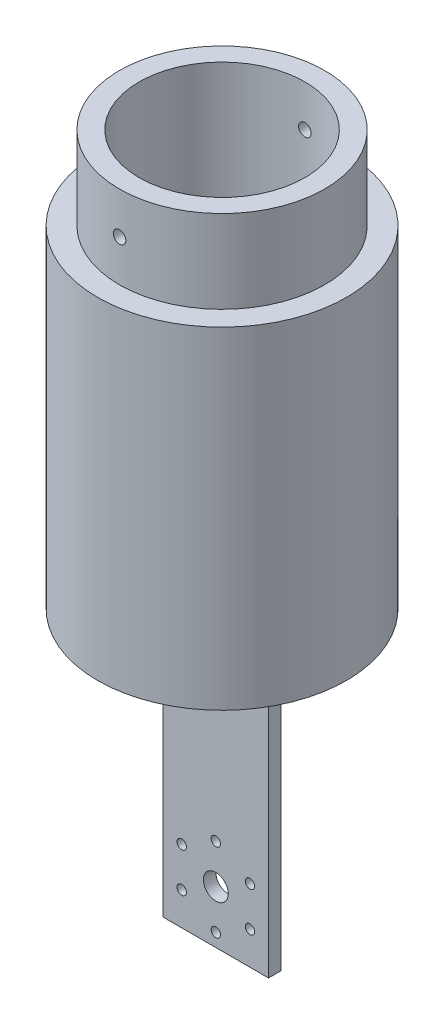
ISO-10303-21;
HEADER;
FILE_DESCRIPTION(('STEP AP214'),'2;1');
FILE_NAME('part.step','',(''),(''),'','','');
FILE_SCHEMA(('AUTOMOTIVE_DESIGN { 1 0 10303 214 1 1 1 1 }'));
ENDSEC;
DATA;
#1=APPLICATION_CONTEXT('core data for automotive mechanical design processes');
#2=APPLICATION_PROTOCOL_DEFINITION('international standard','automotive_design',2000,#1);
#3=PRODUCT_CONTEXT('',#1,'mechanical');
#4=PRODUCT('Part','Part','',(#3));
#5=PRODUCT_RELATED_PRODUCT_CATEGORY('part','',(#4));
#6=PRODUCT_DEFINITION_FORMATION('','',#4);
#7=PRODUCT_DEFINITION_CONTEXT('part definition',#1,'design');
#8=PRODUCT_DEFINITION('design','',#6,#7);
#9=PRODUCT_DEFINITION_SHAPE('','',#8);
#10=(LENGTH_UNIT() NAMED_UNIT(*) SI_UNIT(.MILLI.,.METRE.));
#11=(NAMED_UNIT(*) PLANE_ANGLE_UNIT() SI_UNIT($,.RADIAN.));
#12=(NAMED_UNIT(*) SI_UNIT($,.STERADIAN.) SOLID_ANGLE_UNIT());
#13=UNCERTAINTY_MEASURE_WITH_UNIT(LENGTH_MEASURE(1.E-05),#10,'distance_accuracy_value','');
#14=(GEOMETRIC_REPRESENTATION_CONTEXT(3) GLOBAL_UNCERTAINTY_ASSIGNED_CONTEXT((#13)) GLOBAL_UNIT_ASSIGNED_CONTEXT((#10,
#11,#12)) REPRESENTATION_CONTEXT('',''));
#15=CARTESIAN_POINT('',(0.,0.,0.));
#16=DIRECTION('',(0.,0.,1.));
#17=DIRECTION('',(1.,0.,0.));
#18=AXIS2_PLACEMENT_3D('',#15,#16,#17);
#19=CARTESIAN_POINT('',(12.7,150.,-1.5));
#20=DIRECTION('',(0.,1.,0.));
#21=DIRECTION('',(0.,0.,1.));
#22=AXIS2_PLACEMENT_3D('',#19,#20,#21);
#23=PLANE('',#22);
#24=CARTESIAN_POINT('',(12.7,150.,-1.5));
#25=DIRECTION('',(0.,1.,0.));
#26=DIRECTION('',(0.,0.,1.));
#27=AXIS2_PLACEMENT_3D('',#24,#25,#26);
#28=CIRCLE('',#27,30.);
#29=CARTESIAN_POINT('',(12.7,150.,28.5));
#30=VERTEX_POINT('',#29);
#31=EDGE_CURVE('E230',#30,#30,#28,.T.);
#32=ORIENTED_EDGE('',*,*,#31,.T.);
#33=EDGE_LOOP('',(#32));
#34=FACE_BOUND('',#33,.T.);
#35=CARTESIAN_POINT('',(12.7,150.,-1.5));
#36=DIRECTION('',(0.,1.,0.));
#37=DIRECTION('',(0.,0.,1.));
#38=AXIS2_PLACEMENT_3D('',#35,#36,#37);
#39=CIRCLE('',#38,24.75);
#40=CARTESIAN_POINT('',(12.7,150.,23.25));
#41=VERTEX_POINT('',#40);
#42=EDGE_CURVE('E233',#41,#41,#39,.T.);
#43=ORIENTED_EDGE('',*,*,#42,.F.);
#44=EDGE_LOOP('',(#43));
#45=FACE_BOUND('',#44,.T.);
#46=ADVANCED_FACE('F35',(#34,#45),#23,.T.);
#47=CARTESIAN_POINT('',(0.,70.,-3.));
#48=DIRECTION('',(1.,0.,0.));
#49=DIRECTION('',(0.,0.,-1.));
#50=AXIS2_PLACEMENT_3D('',#47,#48,#49);
#51=PLANE('',#50);
#52=DIRECTION('',(0.,0.,1.));
#53=VECTOR('',#52,1.);
#54=CARTESIAN_POINT('',(0.,0.,-3.));
#55=LINE('',#54,#53);
#56=CARTESIAN_POINT('',(0.,0.,-3.));
#57=VERTEX_POINT('',#56);
#58=CARTESIAN_POINT('',(0.,0.,0.));
#59=VERTEX_POINT('',#58);
#60=EDGE_CURVE('E103',#57,#59,#55,.T.);
#61=ORIENTED_EDGE('',*,*,#60,.T.);
#62=DIRECTION('',(0.,-1.,0.));
#63=VECTOR('',#62,1.);
#64=CARTESIAN_POINT('',(0.,70.,0.));
#65=LINE('',#64,#63);
#66=CARTESIAN_POINT('',(0.,70.,0.));
#67=VERTEX_POINT('',#66);
#68=EDGE_CURVE('E11',#67,#59,#65,.T.);
#69=ORIENTED_EDGE('',*,*,#68,.F.);
#70=DIRECTION('',(0.,0.,1.));
#71=VECTOR('',#70,1.);
#72=CARTESIAN_POINT('',(0.,70.,-3.));
#73=LINE('',#72,#71);
#74=CARTESIAN_POINT('',(0.,70.,-3.));
#75=VERTEX_POINT('',#74);
#76=EDGE_CURVE('E86',#75,#67,#73,.T.);
#77=ORIENTED_EDGE('',*,*,#76,.F.);
#78=DIRECTION('',(0.,-1.,0.));
#79=VECTOR('',#78,1.);
#80=CARTESIAN_POINT('',(0.,70.,-3.));
#81=LINE('',#80,#79);
#82=EDGE_CURVE('E88',#75,#57,#81,.T.);
#83=ORIENTED_EDGE('',*,*,#82,.T.);
#84=EDGE_LOOP('',(#61,#69,#77,#83));
#85=FACE_BOUND('',#84,.T.);
#86=ADVANCED_FACE('F37',(#85),#51,.F.);
#87=CARTESIAN_POINT('',(0.,70.,0.));
#88=DIRECTION('',(0.,0.,-1.));
#89=DIRECTION('',(-1.,0.,0.));
#90=AXIS2_PLACEMENT_3D('',#87,#88,#89);
#91=PLANE('',#90);
#92=CARTESIAN_POINT('',(12.7,12.7,0.));
#93=DIRECTION('',(0.,0.,1.));
#94=DIRECTION('',(1.,0.,0.));
#95=AXIS2_PLACEMENT_3D('',#92,#93,#94);
#96=CIRCLE('',#95,3.);
#97=CARTESIAN_POINT('',(15.7,12.7,0.));
#98=VERTEX_POINT('',#97);
#99=EDGE_CURVE('E203',#98,#98,#96,.T.);
#100=ORIENTED_EDGE('',*,*,#99,.F.);
#101=EDGE_LOOP('',(#100));
#102=FACE_BOUND('',#101,.T.);
#103=CARTESIAN_POINT('',(12.7,22.2,0.));
#104=DIRECTION('',(0.,0.,1.));
#105=DIRECTION('',(1.,0.,0.));
#106=AXIS2_PLACEMENT_3D('',#103,#104,#105);
#107=CIRCLE('',#106,1.13029999999999);
#108=CARTESIAN_POINT('',(13.8303,22.2,0.));
#109=VERTEX_POINT('',#108);
#110=EDGE_CURVE('E207',#109,#109,#107,.T.);
#111=ORIENTED_EDGE('',*,*,#110,.F.);
#112=EDGE_LOOP('',(#111));
#113=FACE_BOUND('',#112,.T.);
#114=CARTESIAN_POINT('',(20.9272413359524,17.4500000000003,0.));
#115=DIRECTION('',(0.,0.,1.));
#116=DIRECTION('',(1.,0.,0.));
#117=AXIS2_PLACEMENT_3D('',#114,#115,#116);
#118=CIRCLE('',#117,1.13029999999999);
#119=CARTESIAN_POINT('',(22.0575413359524,17.4500000000003,0.));
#120=VERTEX_POINT('',#119);
#121=EDGE_CURVE('E211',#120,#120,#118,.T.);
#122=ORIENTED_EDGE('',*,*,#121,.F.);
#123=EDGE_LOOP('',(#122));
#124=FACE_BOUND('',#123,.T.);
#125=CARTESIAN_POINT('',(20.9272413359527,7.95000000000028,0.));
#126=DIRECTION('',(0.,0.,1.));
#127=DIRECTION('',(1.,0.,0.));
#128=AXIS2_PLACEMENT_3D('',#125,#126,#127);
#129=CIRCLE('',#128,1.13029999999999);
#130=CARTESIAN_POINT('',(22.0575413359527,7.95000000000028,0.));
#131=VERTEX_POINT('',#130);
#132=EDGE_CURVE('E215',#131,#131,#129,.T.);
#133=ORIENTED_EDGE('',*,*,#132,.F.);
#134=EDGE_LOOP('',(#133));
#135=FACE_BOUND('',#134,.T.);
#136=CARTESIAN_POINT('',(12.7000000000007,3.2,0.));
#137=DIRECTION('',(0.,0.,1.));
#138=DIRECTION('',(1.,0.,0.));
#139=AXIS2_PLACEMENT_3D('',#136,#137,#138);
#140=CIRCLE('',#139,1.13029999999999);
#141=CARTESIAN_POINT('',(13.8303000000007,3.2,0.));
#142=VERTEX_POINT('',#141);
#143=EDGE_CURVE('E219',#142,#142,#140,.T.);
#144=ORIENTED_EDGE('',*,*,#143,.F.);
#145=EDGE_LOOP('',(#144));
#146=FACE_BOUND('',#145,.T.);
#147=CARTESIAN_POINT('',(4.47275866404834,7.94999999999975,0.));
#148=DIRECTION('',(0.,0.,1.));
#149=DIRECTION('',(1.,0.,0.));
#150=AXIS2_PLACEMENT_3D('',#147,#148,#149);
#151=CIRCLE('',#150,1.13029999999999);
#152=CARTESIAN_POINT('',(5.60305866404833,7.94999999999975,0.));
#153=VERTEX_POINT('',#152);
#154=EDGE_CURVE('E223',#153,#153,#151,.T.);
#155=ORIENTED_EDGE('',*,*,#154,.F.);
#156=EDGE_LOOP('',(#155));
#157=FACE_BOUND('',#156,.T.);
#158=CARTESIAN_POINT('',(4.47275866404807,17.4499999999998,0.));
#159=DIRECTION('',(0.,0.,1.));
#160=DIRECTION('',(1.,0.,0.));
#161=AXIS2_PLACEMENT_3D('',#158,#159,#160);
#162=CIRCLE('',#161,1.13029999999999);
#163=CARTESIAN_POINT('',(5.60305866404806,17.4499999999998,0.));
#164=VERTEX_POINT('',#163);
#165=EDGE_CURVE('E226',#164,#164,#162,.T.);
#166=ORIENTED_EDGE('',*,*,#165,.F.);
#167=EDGE_LOOP('',(#166));
#168=FACE_BOUND('',#167,.T.);
#169=DIRECTION('',(1.,0.,0.));
#170=VECTOR('',#169,1.);
#171=CARTESIAN_POINT('',(0.,0.,0.));
#172=LINE('',#171,#170);
#173=CARTESIAN_POINT('',(25.4,0.,0.));
#174=VERTEX_POINT('',#173);
#175=EDGE_CURVE('E105',#59,#174,#172,.T.);
#176=ORIENTED_EDGE('',*,*,#175,.T.);
#177=DIRECTION('',(0.,-1.,0.));
#178=VECTOR('',#177,1.);
#179=CARTESIAN_POINT('',(25.4,70.,0.));
#180=LINE('',#179,#178);
#181=CARTESIAN_POINT('',(25.4,70.,0.));
#182=VERTEX_POINT('',#181);
#183=EDGE_CURVE('E45',#182,#174,#180,.T.);
#184=ORIENTED_EDGE('',*,*,#183,.F.);
#185=DIRECTION('',(1.,0.,0.));
#186=VECTOR('',#185,1.);
#187=CARTESIAN_POINT('',(0.,70.,0.));
#188=LINE('',#187,#186);
#189=EDGE_CURVE('E80',#67,#182,#188,.T.);
#190=ORIENTED_EDGE('',*,*,#189,.F.);
#191=ORIENTED_EDGE('',*,*,#68,.T.);
#192=EDGE_LOOP('',(#176,#184,#190,#191));
#193=FACE_BOUND('',#192,.T.);
#194=ADVANCED_FACE('F172',(#102,#113,#124,#135,#146,#157,#168,#193),#91,.F.);
#195=CARTESIAN_POINT('',(25.4,70.,0.));
#196=DIRECTION('',(-1.,0.,0.));
#197=DIRECTION('',(0.,0.,1.));
#198=AXIS2_PLACEMENT_3D('',#195,#196,#197);
#199=PLANE('',#198);
#200=DIRECTION('',(0.,0.,-1.));
#201=VECTOR('',#200,1.);
#202=CARTESIAN_POINT('',(25.4,0.,0.));
#203=LINE('',#202,#201);
#204=CARTESIAN_POINT('',(25.4,0.,-3.));
#205=VERTEX_POINT('',#204);
#206=EDGE_CURVE('E70',#174,#205,#203,.T.);
#207=ORIENTED_EDGE('',*,*,#206,.T.);
#208=DIRECTION('',(0.,-1.,0.));
#209=VECTOR('',#208,1.);
#210=CARTESIAN_POINT('',(25.4,70.,-3.));
#211=LINE('',#210,#209);
#212=CARTESIAN_POINT('',(25.4,70.,-3.));
#213=VERTEX_POINT('',#212);
#214=EDGE_CURVE('E54',#213,#205,#211,.T.);
#215=ORIENTED_EDGE('',*,*,#214,.F.);
#216=DIRECTION('',(0.,0.,-1.));
#217=VECTOR('',#216,1.);
#218=CARTESIAN_POINT('',(25.4,70.,0.));
#219=LINE('',#218,#217);
#220=EDGE_CURVE('E98',#182,#213,#219,.T.);
#221=ORIENTED_EDGE('',*,*,#220,.F.);
#222=ORIENTED_EDGE('',*,*,#183,.T.);
#223=EDGE_LOOP('',(#207,#215,#221,#222));
#224=FACE_BOUND('',#223,.T.);
#225=ADVANCED_FACE('F193',(#224),#199,.F.);
#226=CARTESIAN_POINT('',(25.4,70.,-3.));
#227=DIRECTION('',(0.,0.,1.));
#228=DIRECTION('',(1.,0.,0.));
#229=AXIS2_PLACEMENT_3D('',#226,#227,#228);
#230=PLANE('',#229);
#231=CARTESIAN_POINT('',(12.7,12.7,-3.));
#232=DIRECTION('',(0.,0.,1.));
#233=DIRECTION('',(1.,0.,0.));
#234=AXIS2_PLACEMENT_3D('',#231,#232,#233);
#235=CIRCLE('',#234,3.);
#236=CARTESIAN_POINT('',(15.7,12.7,-3.));
#237=VERTEX_POINT('',#236);
#238=EDGE_CURVE('E39',#237,#237,#235,.T.);
#239=ORIENTED_EDGE('',*,*,#238,.T.);
#240=EDGE_LOOP('',(#239));
#241=FACE_BOUND('',#240,.T.);
#242=CARTESIAN_POINT('',(12.7,22.2,-3.));
#243=DIRECTION('',(0.,0.,1.));
#244=DIRECTION('',(1.,0.,0.));
#245=AXIS2_PLACEMENT_3D('',#242,#243,#244);
#246=CIRCLE('',#245,1.13029999999999);
#247=CARTESIAN_POINT('',(13.8303,22.2,-3.));
#248=VERTEX_POINT('',#247);
#249=EDGE_CURVE('E268',#248,#248,#246,.T.);
#250=ORIENTED_EDGE('',*,*,#249,.T.);
#251=EDGE_LOOP('',(#250));
#252=FACE_BOUND('',#251,.T.);
#253=CARTESIAN_POINT('',(20.9272413359524,17.4500000000003,-3.));
#254=DIRECTION('',(0.,0.,1.));
#255=DIRECTION('',(1.,0.,0.));
#256=AXIS2_PLACEMENT_3D('',#253,#254,#255);
#257=CIRCLE('',#256,1.13029999999999);
#258=CARTESIAN_POINT('',(22.0575413359524,17.4500000000003,-3.));
#259=VERTEX_POINT('',#258);
#260=EDGE_CURVE('E264',#259,#259,#257,.T.);
#261=ORIENTED_EDGE('',*,*,#260,.T.);
#262=EDGE_LOOP('',(#261));
#263=FACE_BOUND('',#262,.T.);
#264=CARTESIAN_POINT('',(20.9272413359527,7.95000000000028,-3.));
#265=DIRECTION('',(0.,0.,1.));
#266=DIRECTION('',(1.,0.,0.));
#267=AXIS2_PLACEMENT_3D('',#264,#265,#266);
#268=CIRCLE('',#267,1.13029999999999);
#269=CARTESIAN_POINT('',(22.0575413359527,7.95000000000028,-3.));
#270=VERTEX_POINT('',#269);
#271=EDGE_CURVE('E262',#270,#270,#268,.T.);
#272=ORIENTED_EDGE('',*,*,#271,.T.);
#273=EDGE_LOOP('',(#272));
#274=FACE_BOUND('',#273,.T.);
#275=CARTESIAN_POINT('',(12.7000000000007,3.2,-3.));
#276=DIRECTION('',(0.,0.,1.));
#277=DIRECTION('',(1.,0.,0.));
#278=AXIS2_PLACEMENT_3D('',#275,#276,#277);
#279=CIRCLE('',#278,1.13029999999999);
#280=CARTESIAN_POINT('',(13.8303000000007,3.2,-3.));
#281=VERTEX_POINT('',#280);
#282=EDGE_CURVE('E258',#281,#281,#279,.T.);
#283=ORIENTED_EDGE('',*,*,#282,.T.);
#284=EDGE_LOOP('',(#283));
#285=FACE_BOUND('',#284,.T.);
#286=CARTESIAN_POINT('',(4.47275866404834,7.94999999999975,-3.));
#287=DIRECTION('',(0.,0.,1.));
#288=DIRECTION('',(1.,0.,0.));
#289=AXIS2_PLACEMENT_3D('',#286,#287,#288);
#290=CIRCLE('',#289,1.13029999999999);
#291=CARTESIAN_POINT('',(5.60305866404833,7.94999999999975,-3.));
#292=VERTEX_POINT('',#291);
#293=EDGE_CURVE('E252',#292,#292,#290,.T.);
#294=ORIENTED_EDGE('',*,*,#293,.T.);
#295=EDGE_LOOP('',(#294));
#296=FACE_BOUND('',#295,.T.);
#297=CARTESIAN_POINT('',(4.47275866404807,17.4499999999998,-3.));
#298=DIRECTION('',(0.,0.,1.));
#299=DIRECTION('',(1.,0.,0.));
#300=AXIS2_PLACEMENT_3D('',#297,#298,#299);
#301=CIRCLE('',#300,1.13029999999999);
#302=CARTESIAN_POINT('',(5.60305866404806,17.4499999999998,-3.));
#303=VERTEX_POINT('',#302);
#304=EDGE_CURVE('E120',#303,#303,#301,.T.);
#305=ORIENTED_EDGE('',*,*,#304,.T.);
#306=EDGE_LOOP('',(#305));
#307=FACE_BOUND('',#306,.T.);
#308=DIRECTION('',(-1.,0.,0.));
#309=VECTOR('',#308,1.);
#310=CARTESIAN_POINT('',(25.4,0.,-3.));
#311=LINE('',#310,#309);
#312=EDGE_CURVE('E75',#205,#57,#311,.T.);
#313=ORIENTED_EDGE('',*,*,#312,.T.);
#314=ORIENTED_EDGE('',*,*,#82,.F.);
#315=DIRECTION('',(-1.,0.,0.));
#316=VECTOR('',#315,1.);
#317=CARTESIAN_POINT('',(25.4,70.,-3.));
#318=LINE('',#317,#316);
#319=EDGE_CURVE('E94',#213,#75,#318,.T.);
#320=ORIENTED_EDGE('',*,*,#319,.F.);
#321=ORIENTED_EDGE('',*,*,#214,.T.);
#322=EDGE_LOOP('',(#313,#314,#320,#321));
#323=FACE_BOUND('',#322,.T.);
#324=ADVANCED_FACE('F93',(#241,#252,#263,#274,#285,#296,#307,#323),#230,.F.);
#325=CARTESIAN_POINT('',(0.,0.,0.));
#326=DIRECTION('',(0.,1.,0.));
#327=DIRECTION('',(0.,0.,1.));
#328=AXIS2_PLACEMENT_3D('',#325,#326,#327);
#329=PLANE('',#328);
#330=ORIENTED_EDGE('',*,*,#60,.F.);
#331=ORIENTED_EDGE('',*,*,#312,.F.);
#332=ORIENTED_EDGE('',*,*,#206,.F.);
#333=ORIENTED_EDGE('',*,*,#175,.F.);
#334=EDGE_LOOP('',(#330,#331,#332,#333));
#335=FACE_BOUND('',#334,.T.);
#336=ADVANCED_FACE('F183',(#335),#329,.F.);
#337=CARTESIAN_POINT('',(12.7,70.,-1.5));
#338=DIRECTION('',(0.,1.,0.));
#339=DIRECTION('',(0.,0.,1.));
#340=AXIS2_PLACEMENT_3D('',#337,#338,#339);
#341=PLANE('',#340);
#342=CARTESIAN_POINT('',(12.7,70.,-1.5));
#343=DIRECTION('',(0.,1.,0.));
#344=DIRECTION('',(0.,0.,1.));
#345=AXIS2_PLACEMENT_3D('',#342,#343,#344);
#346=CIRCLE('',#345,30.);
#347=CARTESIAN_POINT('',(12.7,70.,28.5));
#348=VERTEX_POINT('',#347);
#349=EDGE_CURVE('E106',#348,#348,#346,.T.);
#350=ORIENTED_EDGE('',*,*,#349,.F.);
#351=EDGE_LOOP('',(#350));
#352=FACE_BOUND('',#351,.T.);
#353=ORIENTED_EDGE('',*,*,#319,.T.);
#354=ORIENTED_EDGE('',*,*,#76,.T.);
#355=ORIENTED_EDGE('',*,*,#189,.T.);
#356=ORIENTED_EDGE('',*,*,#220,.T.);
#357=EDGE_LOOP('',(#353,#354,#355,#356));
#358=FACE_BOUND('',#357,.T.);
#359=ADVANCED_FACE('F97',(#352,#358),#341,.F.);
#360=CARTESIAN_POINT('',(12.7,80.,-1.5));
#361=DIRECTION('',(0.,-1.,0.));
#362=DIRECTION('',(0.,0.,-1.));
#363=AXIS2_PLACEMENT_3D('',#360,#361,#362);
#364=CYLINDRICAL_SURFACE('',#363,30.);
#365=ORIENTED_EDGE('',*,*,#349,.T.);
#366=EDGE_LOOP('',(#365));
#367=FACE_BOUND('',#366,.T.);
#368=ORIENTED_EDGE('',*,*,#31,.F.);
#369=EDGE_LOOP('',(#368));
#370=FACE_BOUND('',#369,.T.);
#371=ADVANCED_FACE('F163',(#367,#370),#364,.T.);
#372=CARTESIAN_POINT('',(12.7,170.,-1.5));
#373=DIRECTION('',(0.,1.,0.));
#374=DIRECTION('',(0.,0.,1.));
#375=AXIS2_PLACEMENT_3D('',#372,#373,#374);
#376=PLANE('',#375);
#377=CARTESIAN_POINT('',(12.7,170.,-1.5));
#378=DIRECTION('',(0.,1.,0.));
#379=DIRECTION('',(0.,0.,1.));
#380=AXIS2_PLACEMENT_3D('',#377,#378,#379);
#381=CIRCLE('',#380,24.75);
#382=CARTESIAN_POINT('',(12.7,170.,23.25));
#383=VERTEX_POINT('',#382);
#384=EDGE_CURVE('E232',#383,#383,#381,.T.);
#385=ORIENTED_EDGE('',*,*,#384,.T.);
#386=EDGE_LOOP('',(#385));
#387=FACE_BOUND('',#386,.T.);
#388=CARTESIAN_POINT('',(12.7,170.,-1.5));
#389=DIRECTION('',(0.,1.,0.));
#390=DIRECTION('',(0.,0.,1.));
#391=AXIS2_PLACEMENT_3D('',#388,#389,#390);
#392=CIRCLE('',#391,20.);
#393=CARTESIAN_POINT('',(12.7,170.,18.5));
#394=VERTEX_POINT('',#393);
#395=EDGE_CURVE('E236',#394,#394,#392,.T.);
#396=ORIENTED_EDGE('',*,*,#395,.F.);
#397=EDGE_LOOP('',(#396));
#398=FACE_BOUND('',#397,.T.);
#399=ADVANCED_FACE('F136',(#387,#398),#376,.T.);
#400=CARTESIAN_POINT('',(12.7,170.,-1.5));
#401=DIRECTION('',(0.,-1.,0.));
#402=DIRECTION('',(0.,0.,-1.));
#403=AXIS2_PLACEMENT_3D('',#400,#401,#402);
#404=CYLINDRICAL_SURFACE('',#403,24.75);
#405=CARTESIAN_POINT('',(12.7,161.5,-26.25));
#406=CARTESIAN_POINT('',(12.6158272360017,161.499996294486,-26.2499993950914));
#407=CARTESIAN_POINT('',(12.5315954094542,161.492891139931,-26.2495660095077));
#408=CARTESIAN_POINT('',(12.3654572276667,161.4646490504,-26.2478788134059));
#409=CARTESIAN_POINT('',(12.2835537009014,161.443495750373,-26.2466240460632));
#410=CARTESIAN_POINT('',(12.1245027112469,161.387766852012,-26.2434360460326));
#411=CARTESIAN_POINT('',(12.0473527781471,161.353198294272,-26.2415031692811));
#412=CARTESIAN_POINT('',(11.8999708290897,161.271631471199,-26.2371763936826));
#413=CARTESIAN_POINT('',(11.8297372258387,161.224636066986,-26.23478260099));
#414=CARTESIAN_POINT('',(11.6980618011794,161.119476457361,-26.2297993091298));
#415=CARTESIAN_POINT('',(11.6366310616504,161.061298386054,-26.2272095694415));
#416=CARTESIAN_POINT('',(11.5243998825831,160.935453368007,-26.2221283187087));
#417=CARTESIAN_POINT('',(11.4735998855726,160.86778602645,-26.2196368117569));
#418=CARTESIAN_POINT('',(11.3840385183647,160.724821118673,-26.2150311605046));
#419=CARTESIAN_POINT('',(11.345286285553,160.649517818234,-26.2129173031392));
#420=CARTESIAN_POINT('',(11.2809789669607,160.493458800333,-26.2093084213148));
#421=CARTESIAN_POINT('',(11.2554237461974,160.412703138648,-26.2078133905262));
#422=CARTESIAN_POINT('',(11.2182664452143,160.248137927824,-26.2056130328204));
#423=CARTESIAN_POINT('',(11.206647100142,160.164332290202,-26.2049067288416));
#424=CARTESIAN_POINT('',(11.1976380890256,159.995957360624,-26.2043605474928));
#425=CARTESIAN_POINT('',(11.20024826993,159.911388076891,-26.2045206608035));
#426=CARTESIAN_POINT('',(11.219609882258,159.744004060495,-26.2056883508244));
#427=CARTESIAN_POINT('',(11.2363426356229,159.661187158413,-26.2066948081807));
#428=CARTESIAN_POINT('',(11.2834454445906,159.499539764978,-26.2094399992608));
#429=CARTESIAN_POINT('',(11.3138155779227,159.42070929635,-26.2111787371583));
#430=CARTESIAN_POINT('',(11.3873522752411,159.269212444,-26.2151938288594));
#431=CARTESIAN_POINT('',(11.4305273191898,159.196550186278,-26.2174705387273));
#432=CARTESIAN_POINT('',(11.5284421063176,159.059497482265,-26.2223046401809));
#433=CARTESIAN_POINT('',(11.583181971493,158.995107123245,-26.2248620347275));
#434=CARTESIAN_POINT('',(11.7027777691438,158.876317343704,-26.2299742683419));
#435=CARTESIAN_POINT('',(11.7676498679828,158.821934197442,-26.2325290966432));
#436=CARTESIAN_POINT('',(11.9056119544538,158.724828091665,-26.2373443140455));
#437=CARTESIAN_POINT('',(11.9787019448001,158.682105136001,-26.2396047030492));
#438=CARTESIAN_POINT('',(12.1310348697164,158.609533567534,-26.2435764892667));
#439=CARTESIAN_POINT('',(12.2102780948214,158.57968556308,-26.2452878605381));
#440=CARTESIAN_POINT('',(12.3726636862774,158.533722005188,-26.2479684060267));
#441=CARTESIAN_POINT('',(12.4558060097927,158.517606300923,-26.2489375883956));
#442=CARTESIAN_POINT('',(12.6234884777102,158.499584956968,-26.2500234915826));
#443=CARTESIAN_POINT('',(12.7080261953728,158.497656815031,-26.2501415623043));
#444=CARTESIAN_POINT('',(12.8762238796143,158.5080065456,-26.2495155265069));
#445=CARTESIAN_POINT('',(12.9598838504826,158.520284348654,-26.2487714242029));
#446=CARTESIAN_POINT('',(13.1238879059211,158.55867881678,-26.246505685668));
#447=CARTESIAN_POINT('',(13.2042344141761,158.584785166028,-26.2449846290597));
#448=CARTESIAN_POINT('',(13.3594055841374,158.650085188851,-26.2413361268423));
#449=CARTESIAN_POINT('',(13.4342301991168,158.689278973159,-26.2392086761024));
#450=CARTESIAN_POINT('',(13.5763366773499,158.77969863508,-26.2345831167613));
#451=CARTESIAN_POINT('',(13.6436089570357,158.830939550565,-26.2320845463557));
#452=CARTESIAN_POINT('',(13.7686046948817,158.94397703099,-26.2269995153587));
#453=CARTESIAN_POINT('',(13.8263280644694,159.005773693829,-26.2244130539523));
#454=CARTESIAN_POINT('',(13.9306635751308,159.138265524633,-26.2194398545461));
#455=CARTESIAN_POINT('',(13.9772611242699,159.208972194844,-26.2170533814707));
#456=CARTESIAN_POINT('',(14.0579224609094,159.357219075791,-26.2127534913119));
#457=CARTESIAN_POINT('',(14.0919863219554,159.434759246425,-26.2108400714529));
#458=CARTESIAN_POINT('',(14.1465880374304,159.594418622786,-26.2077039742724));
#459=CARTESIAN_POINT('',(14.1671350955915,159.676534671339,-26.2064808270181));
#460=CARTESIAN_POINT('',(14.1941500157145,159.843058740904,-26.2048619041938));
#461=CARTESIAN_POINT('',(14.2006180074679,159.92746674078,-26.2044661209966));
#462=CARTESIAN_POINT('',(14.1992899500819,160.096033564037,-26.204546743532));
#463=CARTESIAN_POINT('',(14.1915168437835,160.180192569806,-26.2050217464026));
#464=CARTESIAN_POINT('',(14.1619747840538,160.346008156434,-26.2067874414229));
#465=CARTESIAN_POINT('',(14.1402058050221,160.427664732714,-26.2080781350647));
#466=CARTESIAN_POINT('',(14.0832950354252,160.586161191196,-26.211329419094));
#467=CARTESIAN_POINT('',(14.0481533032494,160.663001094427,-26.2132900065566));
#468=CARTESIAN_POINT('',(13.9654978304686,160.809692950927,-26.2176600931866));
#469=CARTESIAN_POINT('',(13.9179844201053,160.879545090654,-26.2200695803708));
#470=CARTESIAN_POINT('',(13.811849819092,161.010394705925,-26.2250704477495));
#471=CARTESIAN_POINT('',(13.7532121138786,161.071378775536,-26.2276620947218));
#472=CARTESIAN_POINT('',(13.626514263525,161.18265837378,-26.2327330054645));
#473=CARTESIAN_POINT('',(13.5584518144774,161.232951281282,-26.2352122415584));
#474=CARTESIAN_POINT('',(13.4147630468485,161.32145569831,-26.2397813915809));
#475=CARTESIAN_POINT('',(13.3391278197508,161.359652753332,-26.2418708384972));
#476=CARTESIAN_POINT('',(13.1825603089578,161.422759108663,-26.2454185983165));
#477=CARTESIAN_POINT('',(13.1016343636289,161.447683993214,-26.2468776510496));
#478=CARTESIAN_POINT('',(12.9668433635005,161.477050421526,-26.2486172790852));
#479=CARTESIAN_POINT('',(12.9138498909513,161.485645408483,-26.2491334992661));
#480=CARTESIAN_POINT('',(12.8072456053096,161.497121374603,-26.2498250522267));
#481=CARTESIAN_POINT('',(12.7536347930151,161.500002361149,-26.2500003854471));
#482=CARTESIAN_POINT('',(12.7,161.5,-26.25));
#483=B_SPLINE_CURVE_WITH_KNOTS('',3,(#405,#406,#407,#408,#409,#410,#411,#412,#413,#414,#415,
#416,#417,#418,#419,#420,#421,#422,#423,#424,#425,#426,#427,#428,#429,#430,#431,#432,#433,#434,
#435,#436,#437,#438,#439,#440,#441,#442,#443,#444,#445,#446,#447,#448,#449,#450,#451,#452,#453,
#454,#455,#456,#457,#458,#459,#460,#461,#462,#463,#464,#465,#466,#467,#468,#469,#470,#471,#472,
#473,#474,#475,#476,#477,#478,#479,#480,#481,#482),.UNSPECIFIED.,.T.,.F.,(4,2,2,2,2,2,2,2,2,2,2,
2,2,2,2,2,2,2,2,2,2,2,2,2,2,2,2,2,2,2,2,2,2,2,2,2,2,2,4),(0.,0.252322495126928,
0.504939444144783,0.7574239936502,1.0098504623989,1.26259196913434,1.51534399469492,
1.76828724994961,2.0212279179803,2.27385489857239,2.52647916193554,2.77876983520992,
3.03106194648941,3.28352151095256,3.53598373872267,3.78885297388349,4.04172229256833,
4.29460355816119,4.54748204623717,4.79995936860501,5.0524354566224,5.30472346714171,
5.55701361230943,5.80962036737493,6.0622294654049,6.31516807199719,6.56810519436738,
6.82086991045434,7.07363229635482,7.32598783240442,7.57834383004985,7.83069872584553,
8.08304688612808,8.33577264347983,8.58856028983778,8.84164888651133,9.09443964639671,
9.25521947166412,9.41599908915951),.UNSPECIFIED.);
#484=CARTESIAN_POINT('',(12.7,161.5,-26.25));
#485=VERTEX_POINT('',#484);
#486=EDGE_CURVE('E147',#485,#485,#483,.T.);
#487=ORIENTED_EDGE('',*,*,#486,.T.);
#488=EDGE_LOOP('',(#487));
#489=FACE_BOUND('',#488,.T.);
#490=CARTESIAN_POINT('',(14.2,160.,23.2045036380009));
#491=CARTESIAN_POINT('',(14.199996294341,159.915827396093,23.204504247067));
#492=CARTESIAN_POINT('',(14.1928911658982,159.831595729099,23.2049384501491));
#493=CARTESIAN_POINT('',(14.164649189526,159.665457878837,23.2066285670585));
#494=CARTESIAN_POINT('',(14.1434959760001,159.583554524169,23.207885439246));
#495=CARTESIAN_POINT('',(14.0877673307143,159.424503898316,23.211078006911));
#496=CARTESIAN_POINT('',(14.0531989436741,159.347354155463,23.2130133460534));
#497=CARTESIAN_POINT('',(13.9716325225065,159.199972524777,23.2173443279387));
#498=CARTESIAN_POINT('',(13.9246373490764,159.129739049892,23.2197398647076));
#499=CARTESIAN_POINT('',(13.8194779719006,158.998063478667,23.2247251778596));
#500=CARTESIAN_POINT('',(13.7612998507666,158.936632505251,23.2273151938021));
#501=CARTESIAN_POINT('',(13.6354546350811,158.824400875241,23.2323953950117));
#502=CARTESIAN_POINT('',(13.5677871463494,158.773600660459,23.2348855761262));
#503=CARTESIAN_POINT('',(13.4248221112283,158.684039066788,23.2394875451558));
#504=CARTESIAN_POINT('',(13.3495188559153,158.645286784937,23.2415990466346));
#505=CARTESIAN_POINT('',(13.1934599361357,158.580979363209,23.2452032291485));
#506=CARTESIAN_POINT('',(13.1127043272022,158.555424088941,23.2466959164853));
#507=CARTESIAN_POINT('',(12.9481392713536,158.518266674285,23.2488926319667));
#508=CARTESIAN_POINT('',(12.8643337368437,158.506647265004,23.2495976361096));
#509=CARTESIAN_POINT('',(12.6959590086737,158.497638089751,23.2501428302382));
#510=CARTESIAN_POINT('',(12.6113898232005,158.500248171408,23.2499830294842));
#511=CARTESIAN_POINT('',(12.4440053654319,158.519609627973,23.2488174360853));
#512=CARTESIAN_POINT('',(12.3611879353748,158.53634242469,23.2478127548726));
#513=CARTESIAN_POINT('',(12.1995395083258,158.583445503909,23.2450718001535));
#514=CARTESIAN_POINT('',(12.1207085337752,158.613815863172,23.2433355225291));
#515=CARTESIAN_POINT('',(11.9692110734715,158.68735302546,23.2393249695654));
#516=CARTESIAN_POINT('',(11.8965486878467,158.730528255265,23.2370503401408));
#517=CARTESIAN_POINT('',(11.7594958071209,158.828443437552,23.2322191026159));
#518=CARTESIAN_POINT('',(11.6951053993721,158.883183512144,23.2296624915383));
#519=CARTESIAN_POINT('',(11.5763158614867,159.002779456654,23.2245501964392));
#520=CARTESIAN_POINT('',(11.5219329631826,159.067651450614,23.2219945205183));
#521=CARTESIAN_POINT('',(11.424827307471,159.205613239515,23.2171763345571));
#522=CARTESIAN_POINT('',(11.382104554415,159.278703037522,23.2149138246262));
#523=CARTESIAN_POINT('',(11.309533131083,159.431035913932,23.2109374434511));
#524=CARTESIAN_POINT('',(11.2796851323468,159.510279313049,23.2092236008263));
#525=CARTESIAN_POINT('',(11.2337216393706,159.672665282198,23.2065388595969));
#526=CARTESIAN_POINT('',(11.21760599327,159.755807809101,23.2055679527763));
#527=CARTESIAN_POINT('',(11.1995848681371,159.923490365888,23.2044801107233));
#528=CARTESIAN_POINT('',(11.1976568316575,160.008027963077,23.2043618198888));
#529=CARTESIAN_POINT('',(11.2080067301262,160.176225380911,23.204989008739));
#530=CARTESIAN_POINT('',(11.2202845956301,160.259885205844,23.2057344842012));
#531=CARTESIAN_POINT('',(11.2586790412124,160.423888564423,23.208003955339));
#532=CARTESIAN_POINT('',(11.2847852430138,160.504234536464,23.2095273671362));
#533=CARTESIAN_POINT('',(11.3500847910012,160.659404699388,23.2131805339918));
#534=CARTESIAN_POINT('',(11.3892782487823,160.734228843178,23.2153102942205));
#535=CARTESIAN_POINT('',(11.4796974351409,160.876335009239,23.2199394360589));
#536=CARTESIAN_POINT('',(11.5309382846545,160.943607395071,23.2224392806971));
#537=CARTESIAN_POINT('',(11.6439756933689,161.068603377887,23.2275252511428));
#538=CARTESIAN_POINT('',(11.7057723499688,161.126326886754,23.2301113777462));
#539=CARTESIAN_POINT('',(11.8382642433821,161.230662685758,23.2350824439577));
#540=CARTESIAN_POINT('',(11.908970983194,161.277260383131,23.2374671167174));
#541=CARTESIAN_POINT('',(12.0572180416713,161.357921980119,23.2417627286438));
#542=CARTESIAN_POINT('',(12.1347583202284,161.391985953292,23.2436736705908));
#543=CARTESIAN_POINT('',(12.2944176182045,161.446587745753,23.2468052182996));
#544=CARTESIAN_POINT('',(12.3765334638238,161.467134817287,23.2480262961887));
#545=CARTESIAN_POINT('',(12.543057106421,161.494149832963,23.2496424042679));
#546=CARTESIAN_POINT('',(12.6274648824382,161.500617905822,23.25003744201));
#547=CARTESIAN_POINT('',(12.7960318550489,161.499290079646,23.2499569814279));
#548=CARTESIAN_POINT('',(12.8801912332241,161.491517026692,23.2494828774087));
#549=CARTESIAN_POINT('',(13.0460075776631,161.461974942389,23.2477202234912));
#550=CARTESIAN_POINT('',(13.1276645394685,161.440205886106,23.246431672142));
#551=CARTESIAN_POINT('',(13.2861617515555,161.383294822523,23.2431849787432));
#552=CARTESIAN_POINT('',(13.3630020225999,161.348152872873,23.2412268395801));
#553=CARTESIAN_POINT('',(13.509694523592,161.265496851715,23.2368608850492));
#554=CARTESIAN_POINT('',(13.579546940224,161.21798311085,23.2344530816994));
#555=CARTESIAN_POINT('',(13.7103965250108,161.111848152332,23.2294541005294));
#556=CARTESIAN_POINT('',(13.7713803481037,161.053210495272,23.2268626549113));
#557=CARTESIAN_POINT('',(13.8826594715312,160.92651284181,23.221790557251));
#558=CARTESIAN_POINT('',(13.9329521500977,160.858450540963,23.2193099325028));
#559=CARTESIAN_POINT('',(14.0214563275795,160.714761887966,23.2147370123681));
#560=CARTESIAN_POINT('',(14.0596533290409,160.639126600869,23.2126451842102));
#561=CARTESIAN_POINT('',(14.1227595674847,160.482558961626,23.2090927304909));
#562=CARTESIAN_POINT('',(14.1476843895287,160.401632948191,23.2076313649837));
#563=CARTESIAN_POINT('',(14.1770506372667,160.266842116015,23.2058888330602));
#564=CARTESIAN_POINT('',(14.1856455430666,160.21384889229,23.2053717010971));
#565=CARTESIAN_POINT('',(14.1971214013358,160.107245105444,23.2046789097419));
#566=CARTESIAN_POINT('',(14.2000023612353,160.053634543125,23.2045032499057));
#567=CARTESIAN_POINT('',(14.2,160.,23.2045036380009));
#568=B_SPLINE_CURVE_WITH_KNOTS('',3,(#490,#491,#492,#493,#494,#495,#496,#497,#498,#499,#500,
#501,#502,#503,#504,#505,#506,#507,#508,#509,#510,#511,#512,#513,#514,#515,#516,#517,#518,#519,
#520,#521,#522,#523,#524,#525,#526,#527,#528,#529,#530,#531,#532,#533,#534,#535,#536,#537,#538,
#539,#540,#541,#542,#543,#544,#545,#546,#547,#548,#549,#550,#551,#552,#553,#554,#555,#556,#557,
#558,#559,#560,#561,#562,#563,#564,#565,#566,#567),.UNSPECIFIED.,.T.,.F.,(4,2,2,2,2,2,2,2,2,2,2,
2,2,2,2,2,2,2,2,2,2,2,2,2,2,2,2,2,2,2,2,2,2,2,2,2,2,2,4),(0.,0.252322014318652,
0.504938493039601,0.757422494203331,1.00984842303469,1.26259055878275,1.51534319633626,
1.76828621901626,2.02122666582501,2.27385335173717,2.52647733250081,2.77876950773643,
3.03106310305205,3.28352310052394,3.53598576375446,3.78885437125696,4.04172307312868,
4.29460496289288,4.54748405610021,4.79996099968816,5.05243670906845,5.3047232013264,
5.55701184488541,5.80961884778122,6.06222818162637,6.31516704322556,6.56810442033516,
6.82086848252163,7.07363023382985,7.3259868514642,7.57834391867833,7.83069989801187,
8.0830491337164,8.33577424901388,8.58856126827845,8.8416501323617,9.09444114386679,
9.25522022077132,9.41599908860193),.UNSPECIFIED.);
#569=CARTESIAN_POINT('',(14.2,160.,23.2045036380009));
#570=VERTEX_POINT('',#569);
#571=EDGE_CURVE('E142',#570,#570,#568,.T.);
#572=ORIENTED_EDGE('',*,*,#571,.T.);
#573=EDGE_LOOP('',(#572));
#574=FACE_BOUND('',#573,.T.);
#575=ORIENTED_EDGE('',*,*,#384,.F.);
#576=EDGE_LOOP('',(#575));
#577=FACE_BOUND('',#576,.T.);
#578=ORIENTED_EDGE('',*,*,#42,.T.);
#579=EDGE_LOOP('',(#578));
#580=FACE_BOUND('',#579,.T.);
#581=ADVANCED_FACE('F152',(#489,#574,#577,#580),#404,.T.);
#582=CARTESIAN_POINT('',(12.7,150.,-1.5));
#583=DIRECTION('',(0.,-1.,0.));
#584=DIRECTION('',(0.,0.,-1.));
#585=AXIS2_PLACEMENT_3D('',#582,#583,#584);
#586=CYLINDRICAL_SURFACE('',#585,20.);
#587=CARTESIAN_POINT('',(12.7,140.,-1.5));
#588=DIRECTION('',(0.,1.,0.));
#589=DIRECTION('',(0.,0.,1.));
#590=AXIS2_PLACEMENT_3D('',#587,#588,#589);
#591=CIRCLE('',#590,20.);
#592=CARTESIAN_POINT('',(12.7,140.,18.5));
#593=VERTEX_POINT('',#592);
#594=EDGE_CURVE('E277',#593,#593,#591,.T.);
#595=ORIENTED_EDGE('',*,*,#594,.F.);
#596=EDGE_LOOP('',(#595));
#597=FACE_BOUND('',#596,.T.);
#598=CARTESIAN_POINT('',(12.7,161.5,-21.5));
#599=CARTESIAN_POINT('',(12.6158711904886,161.499996313183,-21.4999992582729));
#600=CARTESIAN_POINT('',(12.5316843989759,161.492898546559,-21.4994635090758));
#601=CARTESIAN_POINT('',(12.3656380580285,161.464687515457,-21.4973778078798));
#602=CARTESIAN_POINT('',(12.283781288837,161.443558183763,-21.4958266932389));
#603=CARTESIAN_POINT('',(12.1248240340402,161.38789667188,-21.4918856268593));
#604=CARTESIAN_POINT('',(12.0477209630649,161.353371852892,-21.4894961359011));
#605=CARTESIAN_POINT('',(11.900423519322,161.271912047136,-21.4841466247064));
#606=CARTESIAN_POINT('',(11.8302276282002,161.224979796204,-21.4811867302827));
#607=CARTESIAN_POINT('',(11.6985710424675,161.119930779463,-21.475021868989));
#608=CARTESIAN_POINT('',(11.6371267702815,161.061793455916,-21.471816458291));
#609=CARTESIAN_POINT('',(11.5248583463022,160.936027702655,-21.4655255838438));
#610=CARTESIAN_POINT('',(11.4740346509573,160.868398865226,-21.4624401252546));
#611=CARTESIAN_POINT('',(11.3843961612523,160.725472545191,-21.4567335395977));
#612=CARTESIAN_POINT('',(11.3455955318967,160.65016615497,-21.454112961772));
#613=CARTESIAN_POINT('',(11.2811951095322,160.494084627656,-21.4496376121017));
#614=CARTESIAN_POINT('',(11.2555951231131,160.413309570707,-21.447782829037));
#615=CARTESIAN_POINT('',(11.2183696234207,160.248746107599,-21.4450525889002));
#616=CARTESIAN_POINT('',(11.2067176895578,160.164963709192,-21.4441752805014));
#617=CARTESIAN_POINT('',(11.1976374542516,159.996628046739,-21.4434933892539));
#618=CARTESIAN_POINT('',(11.2002089318914,159.912074794687,-21.4436887897441));
#619=CARTESIAN_POINT('',(11.2194806558243,159.744778188946,-21.4451285636931));
#620=CARTESIAN_POINT('',(11.2361522432361,159.662031513036,-21.4463708093904));
#621=CARTESIAN_POINT('',(11.2831064477308,159.500514302884,-21.4497609519804));
#622=CARTESIAN_POINT('',(11.3133891755266,159.421743800991,-21.4519088562398));
#623=CARTESIAN_POINT('',(11.386738328103,159.270323283761,-21.4568707353614));
#624=CARTESIAN_POINT('',(11.429817672735,159.197679549823,-21.4596853828032));
#625=CARTESIAN_POINT('',(11.5275278625658,159.060643337135,-21.4656629459514));
#626=CARTESIAN_POINT('',(11.5821588965712,158.996250993278,-21.4688258673499));
#627=CARTESIAN_POINT('',(11.7015827215677,158.877378741756,-21.4751530336147));
#628=CARTESIAN_POINT('',(11.7664002998237,158.822923732405,-21.478317262423));
#629=CARTESIAN_POINT('',(11.9042706240656,158.725664236434,-21.4842830152099));
#630=CARTESIAN_POINT('',(11.9773233742814,158.682859755799,-21.4870845390023));
#631=CARTESIAN_POINT('',(12.1296060597837,158.610118169756,-21.4920096041928));
#632=CARTESIAN_POINT('',(12.208836490571,158.580182097759,-21.4941330911371));
#633=CARTESIAN_POINT('',(12.3712183472254,158.534044187795,-21.4974621500133));
#634=CARTESIAN_POINT('',(12.4543697071574,158.517842118962,-21.498667737375));
#635=CARTESIAN_POINT('',(12.6220171562162,158.499663190461,-21.5000231735387));
#636=CARTESIAN_POINT('',(12.7065094948253,158.497651925346,-21.5001755757578));
#637=CARTESIAN_POINT('',(12.8746302309931,158.50782166807,-21.4994142771364));
#638=CARTESIAN_POINT('',(12.9582586350546,158.520002569005,-21.4985005843263));
#639=CARTESIAN_POINT('',(13.1221800111765,158.558182368811,-21.4957115375324));
#640=CARTESIAN_POINT('',(13.2024767016461,158.584165390559,-21.4938372886011));
#641=CARTESIAN_POINT('',(13.357570327384,158.649195693637,-21.4893378090841));
#642=CARTESIAN_POINT('',(13.4323671917994,158.688243143237,-21.4867125688255));
#643=CARTESIAN_POINT('',(13.5744949593768,158.778380837898,-21.4809993255836));
#644=CARTESIAN_POINT('',(13.6418113202556,158.829493956719,-21.4779104477497));
#645=CARTESIAN_POINT('',(13.766920596017,158.942278925469,-21.4716201639251));
#646=CARTESIAN_POINT('',(13.8247133767348,159.003950924123,-21.4684187563499));
#647=CARTESIAN_POINT('',(13.9292523497916,159.136251940132,-21.4622567375937));
#648=CARTESIAN_POINT('',(13.9759761470877,159.206898679433,-21.4592966224009));
#649=CARTESIAN_POINT('',(14.0568974447261,159.355055198382,-21.4539590285433));
#650=CARTESIAN_POINT('',(14.0910950495869,159.432564920758,-21.451581545017));
#651=CARTESIAN_POINT('',(14.1459547923846,159.592166807487,-21.4476809567371));
#652=CARTESIAN_POINT('',(14.1666308067291,159.674254179853,-21.4461569763152));
#653=CARTESIAN_POINT('',(14.1939056933918,159.840747231016,-21.4441328652441));
#654=CARTESIAN_POINT('',(14.2005047790739,159.925152874656,-21.4436327190765));
#655=CARTESIAN_POINT('',(14.1994362155316,160.093663913247,-21.4437130691626));
#656=CARTESIAN_POINT('',(14.1918037608572,160.177769534896,-21.4442908995857));
#657=CARTESIAN_POINT('',(14.162561981934,160.34350108371,-21.4464564369575));
#658=CARTESIAN_POINT('',(14.1409526344339,160.42512700675,-21.4480441455862));
#659=CARTESIAN_POINT('',(14.0843790027353,160.583585608422,-21.452049853556));
#660=CARTESIAN_POINT('',(14.0494151584096,160.660418444833,-21.4544678255495));
#661=CARTESIAN_POINT('',(13.9671292461968,160.807128957715,-21.4598616237908));
#662=CARTESIAN_POINT('',(13.9198074268101,160.877006774002,-21.4628374388209));
#663=CARTESIAN_POINT('',(13.8140170894673,161.008003349971,-21.4690203079162));
#664=CARTESIAN_POINT('',(13.7555226882,161.06910118164,-21.4722278879631));
#665=CARTESIAN_POINT('',(13.6290909734527,161.180634050311,-21.4785081329158));
#666=CARTESIAN_POINT('',(13.5611513677957,161.231066491506,-21.4815807648333));
#667=CARTESIAN_POINT('',(13.4176504166038,161.319891162539,-21.4872494022766));
#668=CARTESIAN_POINT('',(13.3420771482674,161.358264160491,-21.4898446437752));
#669=CARTESIAN_POINT('',(13.1855939179152,161.42172828444,-21.4942566719576));
#670=CARTESIAN_POINT('',(13.1046902637377,161.446834803068,-21.4960743603405));
#671=CARTESIAN_POINT('',(12.9694179167244,161.476601988527,-21.4982556200579));
#672=CARTESIAN_POINT('',(12.915921192938,161.485364718789,-21.4989068154638));
#673=CARTESIAN_POINT('',(12.808290987948,161.497064905152,-21.4997792437292));
#674=CARTESIAN_POINT('',(12.7541575080691,161.50000237337,-21.5000004774832));
#675=CARTESIAN_POINT('',(12.7,161.5,-21.5));
#676=B_SPLINE_CURVE_WITH_KNOTS('',3,(#598,#599,#600,#601,#602,#603,#604,#605,#606,#607,#608,
#609,#610,#611,#612,#613,#614,#615,#616,#617,#618,#619,#620,#621,#622,#623,#624,#625,#626,#627,
#628,#629,#630,#631,#632,#633,#634,#635,#636,#637,#638,#639,#640,#641,#642,#643,#644,#645,#646,
#647,#648,#649,#650,#651,#652,#653,#654,#655,#656,#657,#658,#659,#660,#661,#662,#663,#664,#665,
#666,#667,#668,#669,#670,#671,#672,#673,#674,#675),.UNSPECIFIED.,.T.,.F.,(4,2,2,2,2,2,2,2,2,2,2,
2,2,2,2,2,2,2,2,2,2,2,2,2,2,2,2,2,2,2,2,2,2,2,2,2,2,2,4),(0.,0.252188706341403,0.50466668711607,
0.757006120137031,1.00928995874567,1.2620411413344,1.51480318436673,1.76786189721258,
2.02091690224425,2.27349180470369,2.52606278420135,2.77812163616427,3.0301825384079,
3.28249879898396,3.53481918386621,3.78776333637313,4.04070761880365,4.29367221036426,
4.54663254953897,4.79897937776531,5.05132430518305,5.30337957695229,5.55543809532427,
5.8079783521194,6.06052216631005,6.3135726511564,6.56662102450257,6.81940930006921,
7.07219374409738,7.32435388202406,7.57651443943157,7.82866669184702,8.0808138742512,
8.33355244628149,8.5863524607211,8.83955360771713,9.09246032562225,9.25480590484757,
9.41715114636385),.UNSPECIFIED.);
#677=CARTESIAN_POINT('',(12.7,161.5,-21.5));
#678=VERTEX_POINT('',#677);
#679=EDGE_CURVE('E119',#678,#678,#676,.T.);
#680=ORIENTED_EDGE('',*,*,#679,.F.);
#681=EDGE_LOOP('',(#680));
#682=FACE_BOUND('',#681,.T.);
#683=CARTESIAN_POINT('',(14.2,160.,18.4436706751791));
#684=CARTESIAN_POINT('',(14.199996312844,159.915871565722,18.443671424711));
#685=CARTESIAN_POINT('',(14.1928986073944,159.831685148205,18.4442087219975));
#686=CARTESIAN_POINT('',(14.1646878413798,159.665639584352,18.4462999542359));
#687=CARTESIAN_POINT('',(14.1435587123183,159.583783218552,18.4478550547254));
#688=CARTESIAN_POINT('',(14.0878977932492,159.42482681657,18.4518047691616));
#689=CARTESIAN_POINT('',(14.0533733740953,159.347724191601,18.4541989213442));
#690=CARTESIAN_POINT('',(13.9719145097985,159.200427494542,18.4595563959789));
#691=CARTESIAN_POINT('',(13.924982799502,159.13023190466,18.4625195929615));
#692=CARTESIAN_POINT('',(13.8199343278142,158.998574976216,18.4686882981736));
#693=CARTESIAN_POINT('',(13.7617968880053,158.937130156104,18.4718942476191));
#694=CARTESIAN_POINT('',(13.6360306725068,158.824860675352,18.4781831621206));
#695=CARTESIAN_POINT('',(13.568401490593,158.774036469481,18.4812661219056));
#696=CARTESIAN_POINT('',(13.4254748712688,158.684397447915,18.4869657395593));
#697=CARTESIAN_POINT('',(13.3501685854615,158.645596702905,18.4895818495818));
#698=CARTESIAN_POINT('',(13.1940872851566,158.58119603788,18.4940482820627));
#699=CARTESIAN_POINT('',(13.1133123502278,158.555595925841,18.4958986156604));
#700=CARTESIAN_POINT('',(12.948749250367,158.518370160696,18.4986219399733));
#701=CARTESIAN_POINT('',(12.8649670953537,158.506718077022,18.4994967789682));
#702=CARTESIAN_POINT('',(12.6966319086957,158.497637457776,18.5001767917244));
#703=CARTESIAN_POINT('',(12.6120788889576,158.500208702885,18.4999819819792));
#704=CARTESIAN_POINT('',(12.4447812518501,158.519480060854,18.4985461791421));
#705=CARTESIAN_POINT('',(12.362033339589,158.536151748842,18.4973072908106));
#706=CARTESIAN_POINT('',(12.2005137085875,158.583106583898,18.4939251552444));
#707=CARTESIAN_POINT('',(12.1217420215354,158.613389839425,18.4917819008036));
#708=CARTESIAN_POINT('',(11.9703200761511,158.686740080183,18.4868286111045));
#709=CARTESIAN_POINT('',(11.8976760390085,158.729819861391,18.4840179089941));
#710=CARTESIAN_POINT('',(11.7606394054969,158.827530980592,18.478045787876));
#711=CARTESIAN_POINT('',(11.6962469442019,158.882162507643,18.4748843631288));
#712=CARTESIAN_POINT('',(11.5773752577708,159.001586679657,18.4685571200843));
#713=CARTESIAN_POINT('',(11.5229208311625,159.066404011916,18.4653913101349));
#714=CARTESIAN_POINT('',(11.4256623933425,159.204273637329,18.459419970567));
#715=CARTESIAN_POINT('',(11.3828583893,159.277325935551,18.4566144411701));
#716=CARTESIAN_POINT('',(11.3101171450959,159.429608504375,18.4516806682916));
#717=CARTESIAN_POINT('',(11.2801810865272,159.50883934153,18.4495524870119));
#718=CARTESIAN_POINT('',(11.2340433282021,159.671222080609,18.4462154499794));
#719=CARTESIAN_POINT('',(11.217841395148,159.754373915904,18.4450065786106));
#720=CARTESIAN_POINT('',(11.1996629779054,159.922021576907,18.4436474451507));
#721=CARTESIAN_POINT('',(11.1976519598538,160.006513638092,18.4434946131863));
#722=CARTESIAN_POINT('',(11.2078220976604,160.174633759851,18.4442580734706));
#723=CARTESIAN_POINT('',(11.2200031466256,160.258261826928,18.4451743576668));
#724=CARTESIAN_POINT('',(11.2581828983003,160.422181573356,18.4479704572233));
#725=CARTESIAN_POINT('',(11.2841655767212,160.502477005716,18.4498491550899));
#726=CARTESIAN_POINT('',(11.349194771212,160.657568267374,18.4543574532934));
#727=CARTESIAN_POINT('',(11.3882414575664,160.732364024971,18.4569870634181));
#728=CARTESIAN_POINT('',(11.4783780368438,160.874491052557,18.4627071136634));
#729=CARTESIAN_POINT('',(11.5294909976105,160.941807657102,18.4657984322502));
#730=CARTESIAN_POINT('',(11.6422757896651,161.066917498243,18.4720905549617));
#731=CARTESIAN_POINT('',(11.7039477685158,161.124710601727,18.475291360616));
#732=CARTESIAN_POINT('',(11.8362489283356,161.229250252108,18.4814493930731));
#733=CARTESIAN_POINT('',(11.9068958341917,161.275974400694,18.4844061182321));
#734=CARTESIAN_POINT('',(12.0550527780098,161.356896315094,18.4897356262579));
#735=CARTESIAN_POINT('',(12.1325627586698,161.391094185481,18.4921084139996));
#736=CARTESIAN_POINT('',(12.2921644660077,161.445954108355,18.4960003563777));
#737=CARTESIAN_POINT('',(12.3742513610568,161.466630152209,18.4975203931443));
#738=CARTESIAN_POINT('',(12.5407434071797,161.4939052597,18.4995391228448));
#739=CARTESIAN_POINT('',(12.6251485235144,161.500504534164,18.5000378310751));
#740=CARTESIAN_POINT('',(12.7936599022297,161.499436512789,18.4999577474694));
#741=CARTESIAN_POINT('',(12.8777663897163,161.491804185436,18.499381596669));
#742=CARTESIAN_POINT('',(13.043499701495,161.462562356169,18.4972217798986));
#743=CARTESIAN_POINT('',(13.1251265219356,161.440952832545,18.4956381123638));
#744=CARTESIAN_POINT('',(13.2835868919689,161.384378519457,18.4916410805027));
#745=CARTESIAN_POINT('',(13.3604205979813,161.349414166082,18.489227743269));
#746=CARTESIAN_POINT('',(13.5071326370331,161.267126967247,18.4838417849228));
#747=CARTESIAN_POINT('',(13.5770111104249,161.219804371238,18.4808691750997));
#748=CARTESIAN_POINT('',(13.7080076253239,161.114013189242,18.4746899428358));
#749=CARTESIAN_POINT('',(13.7691048813846,161.055518896888,18.4714827914222));
#750=CARTESIAN_POINT('',(13.8806366396831,160.929087635472,18.4652003844937));
#751=CARTESIAN_POINT('',(13.9310685446205,160.861148372964,18.4621251612519));
#752=CARTESIAN_POINT('',(14.0198926494262,160.717647691718,18.4564494251809));
#753=CARTESIAN_POINT('',(14.0582655181887,160.642074288797,18.4538496773175));
#754=CARTESIAN_POINT('',(14.12172936313,160.485590771064,18.4494287405787));
#755=CARTESIAN_POINT('',(14.1468357338408,160.404686964898,18.4476066497794));
#756=CARTESIAN_POINT('',(14.1766024953312,160.269415014845,18.4454198272495));
#757=CARTESIAN_POINT('',(14.1853650349203,160.215918869999,18.4447668737592));
#758=CARTESIAN_POINT('',(14.1970649679238,160.108289825343,18.4438920569245));
#759=CARTESIAN_POINT('',(14.2000023735737,160.054156926873,18.4436701926747));
#760=CARTESIAN_POINT('',(14.2,160.,18.4436706751791));
#761=B_SPLINE_CURVE_WITH_KNOTS('',3,(#683,#684,#685,#686,#687,#688,#689,#690,#691,#692,#693,
#694,#695,#696,#697,#698,#699,#700,#701,#702,#703,#704,#705,#706,#707,#708,#709,#710,#711,#712,
#713,#714,#715,#716,#717,#718,#719,#720,#721,#722,#723,#724,#725,#726,#727,#728,#729,#730,#731,
#732,#733,#734,#735,#736,#737,#738,#739,#740,#741,#742,#743,#744,#745,#746,#747,#748,#749,#750,
#751,#752,#753,#754,#755,#756,#757,#758,#759,#760),.UNSPECIFIED.,.T.,.F.,(4,2,2,2,2,2,2,2,2,2,2,
2,2,2,2,2,2,2,2,2,2,2,2,2,2,2,2,2,2,2,2,2,2,2,2,2,2,2,4),(0.,0.252187579339044,
0.504664457860811,0.75700260576218,1.00928517896144,1.26203783609004,1.51480131373582,
1.76785948521028,2.0209139754847,2.27348818174163,2.52605849341279,2.77812086259582,
3.030185240264,3.28250252487077,3.53482393925046,3.78776661406381,4.04070944452774,
4.29367549638821,4.54663725110237,4.79898320559481,5.05132725946132,5.30337896930958,
5.55543396468606,5.80797478825662,6.06051914138528,6.31357024084873,6.56661922770343,
6.81940596249452,7.07218891127968,7.32435156508924,7.57651461054475,7.82866942254428,
8.08081914517809,8.33355621784141,8.58635476809667,8.83955652118658,9.09246380844974,
9.25480764733519,9.41715114522216),.UNSPECIFIED.);
#762=CARTESIAN_POINT('',(14.2,160.,18.4436706751791));
#763=VERTEX_POINT('',#762);
#764=EDGE_CURVE('E112',#763,#763,#761,.T.);
#765=ORIENTED_EDGE('',*,*,#764,.F.);
#766=EDGE_LOOP('',(#765));
#767=FACE_BOUND('',#766,.T.);
#768=ORIENTED_EDGE('',*,*,#395,.T.);
#769=EDGE_LOOP('',(#768));
#770=FACE_BOUND('',#769,.T.);
#771=ADVANCED_FACE('F123',(#597,#682,#767,#770),#586,.F.);
#772=CARTESIAN_POINT('',(12.7,160.,-31.5));
#773=DIRECTION('',(0.,0.,1.));
#774=DIRECTION('',(1.,0.,0.));
#775=AXIS2_PLACEMENT_3D('',#772,#773,#774);
#776=CYLINDRICAL_SURFACE('',#775,1.5);
#777=ORIENTED_EDGE('',*,*,#764,.T.);
#778=EDGE_LOOP('',(#777));
#779=FACE_BOUND('',#778,.T.);
#780=ORIENTED_EDGE('',*,*,#571,.F.);
#781=EDGE_LOOP('',(#780));
#782=FACE_BOUND('',#781,.T.);
#783=ADVANCED_FACE('F133',(#779,#782),#776,.F.);
#784=ORIENTED_EDGE('',*,*,#679,.T.);
#785=EDGE_LOOP('',(#784));
#786=FACE_BOUND('',#785,.T.);
#787=ORIENTED_EDGE('',*,*,#486,.F.);
#788=EDGE_LOOP('',(#787));
#789=FACE_BOUND('',#788,.T.);
#790=ADVANCED_FACE('F127',(#786,#789),#776,.F.);
#791=CARTESIAN_POINT('',(4.47275866404807,17.4499999999998,0.));
#792=DIRECTION('',(0.,0.,1.));
#793=DIRECTION('',(1.,0.,0.));
#794=AXIS2_PLACEMENT_3D('',#791,#792,#793);
#795=CYLINDRICAL_SURFACE('',#794,1.13029999999999);
#796=ORIENTED_EDGE('',*,*,#165,.T.);
#797=EDGE_LOOP('',(#796));
#798=FACE_BOUND('',#797,.T.);
#799=ORIENTED_EDGE('',*,*,#304,.F.);
#800=EDGE_LOOP('',(#799));
#801=FACE_BOUND('',#800,.T.);
#802=ADVANCED_FACE('F132',(#798,#801),#795,.F.);
#803=CARTESIAN_POINT('',(4.47275866404834,7.94999999999975,0.));
#804=DIRECTION('',(0.,0.,1.));
#805=DIRECTION('',(1.,0.,0.));
#806=AXIS2_PLACEMENT_3D('',#803,#804,#805);
#807=CYLINDRICAL_SURFACE('',#806,1.13029999999999);
#808=ORIENTED_EDGE('',*,*,#154,.T.);
#809=EDGE_LOOP('',(#808));
#810=FACE_BOUND('',#809,.T.);
#811=ORIENTED_EDGE('',*,*,#293,.F.);
#812=EDGE_LOOP('',(#811));
#813=FACE_BOUND('',#812,.T.);
#814=ADVANCED_FACE('F308',(#810,#813),#807,.F.);
#815=CARTESIAN_POINT('',(12.7000000000007,3.2,0.));
#816=DIRECTION('',(0.,0.,1.));
#817=DIRECTION('',(1.,0.,0.));
#818=AXIS2_PLACEMENT_3D('',#815,#816,#817);
#819=CYLINDRICAL_SURFACE('',#818,1.13029999999999);
#820=ORIENTED_EDGE('',*,*,#143,.T.);
#821=EDGE_LOOP('',(#820));
#822=FACE_BOUND('',#821,.T.);
#823=ORIENTED_EDGE('',*,*,#282,.F.);
#824=EDGE_LOOP('',(#823));
#825=FACE_BOUND('',#824,.T.);
#826=ADVANCED_FACE('F313',(#822,#825),#819,.F.);
#827=CARTESIAN_POINT('',(20.9272413359527,7.95000000000028,0.));
#828=DIRECTION('',(0.,0.,1.));
#829=DIRECTION('',(1.,0.,0.));
#830=AXIS2_PLACEMENT_3D('',#827,#828,#829);
#831=CYLINDRICAL_SURFACE('',#830,1.13029999999999);
#832=ORIENTED_EDGE('',*,*,#132,.T.);
#833=EDGE_LOOP('',(#832));
#834=FACE_BOUND('',#833,.T.);
#835=ORIENTED_EDGE('',*,*,#271,.F.);
#836=EDGE_LOOP('',(#835));
#837=FACE_BOUND('',#836,.T.);
#838=ADVANCED_FACE('F320',(#834,#837),#831,.F.);
#839=CARTESIAN_POINT('',(20.9272413359524,17.4500000000003,0.));
#840=DIRECTION('',(0.,0.,1.));
#841=DIRECTION('',(1.,0.,0.));
#842=AXIS2_PLACEMENT_3D('',#839,#840,#841);
#843=CYLINDRICAL_SURFACE('',#842,1.13029999999999);
#844=ORIENTED_EDGE('',*,*,#121,.T.);
#845=EDGE_LOOP('',(#844));
#846=FACE_BOUND('',#845,.T.);
#847=ORIENTED_EDGE('',*,*,#260,.F.);
#848=EDGE_LOOP('',(#847));
#849=FACE_BOUND('',#848,.T.);
#850=ADVANCED_FACE('F328',(#846,#849),#843,.F.);
#851=CARTESIAN_POINT('',(12.7,22.2,0.));
#852=DIRECTION('',(0.,0.,1.));
#853=DIRECTION('',(1.,0.,0.));
#854=AXIS2_PLACEMENT_3D('',#851,#852,#853);
#855=CYLINDRICAL_SURFACE('',#854,1.13029999999999);
#856=ORIENTED_EDGE('',*,*,#110,.T.);
#857=EDGE_LOOP('',(#856));
#858=FACE_BOUND('',#857,.T.);
#859=ORIENTED_EDGE('',*,*,#249,.F.);
#860=EDGE_LOOP('',(#859));
#861=FACE_BOUND('',#860,.T.);
#862=ADVANCED_FACE('F336',(#858,#861),#855,.F.);
#863=CARTESIAN_POINT('',(12.7,12.7,-10.));
#864=DIRECTION('',(0.,0.,1.));
#865=DIRECTION('',(1.,0.,0.));
#866=AXIS2_PLACEMENT_3D('',#863,#864,#865);
#867=CYLINDRICAL_SURFACE('',#866,3.);
#868=ORIENTED_EDGE('',*,*,#99,.T.);
#869=EDGE_LOOP('',(#868));
#870=FACE_BOUND('',#869,.T.);
#871=ORIENTED_EDGE('',*,*,#238,.F.);
#872=EDGE_LOOP('',(#871));
#873=FACE_BOUND('',#872,.T.);
#874=ADVANCED_FACE('F344',(#870,#873),#867,.F.);
#875=CARTESIAN_POINT('',(12.7,140.,-1.5));
#876=DIRECTION('',(0.,1.,0.));
#877=DIRECTION('',(0.,0.,1.));
#878=AXIS2_PLACEMENT_3D('',#875,#876,#877);
#879=PLANE('',#878);
#880=CARTESIAN_POINT('',(12.7,140.,-1.5));
#881=DIRECTION('',(0.,1.,0.));
#882=DIRECTION('',(0.,0.,1.));
#883=AXIS2_PLACEMENT_3D('',#880,#881,#882);
#884=CIRCLE('',#883,27.);
#885=CARTESIAN_POINT('',(12.7,140.,25.5));
#886=VERTEX_POINT('',#885);
#887=EDGE_CURVE('E273',#886,#886,#884,.T.);
#888=ORIENTED_EDGE('',*,*,#887,.F.);
#889=EDGE_LOOP('',(#888));
#890=FACE_BOUND('',#889,.T.);
#891=ORIENTED_EDGE('',*,*,#594,.T.);
#892=EDGE_LOOP('',(#891));
#893=FACE_BOUND('',#892,.T.);
#894=ADVANCED_FACE('F283',(#890,#893),#879,.F.);
#895=CARTESIAN_POINT('',(12.7,140.,-1.5));
#896=DIRECTION('',(0.,-1.,0.));
#897=DIRECTION('',(0.,0.,-1.));
#898=AXIS2_PLACEMENT_3D('',#895,#896,#897);
#899=CYLINDRICAL_SURFACE('',#898,27.);
#900=ORIENTED_EDGE('',*,*,#887,.T.);
#901=EDGE_LOOP('',(#900));
#902=FACE_BOUND('',#901,.T.);
#903=CARTESIAN_POINT('',(12.7,80.,-1.5));
#904=DIRECTION('',(0.,1.,0.));
#905=DIRECTION('',(0.,0.,1.));
#906=AXIS2_PLACEMENT_3D('',#903,#904,#905);
#907=CIRCLE('',#906,27.);
#908=CARTESIAN_POINT('',(12.7,80.,25.5));
#909=VERTEX_POINT('',#908);
#910=EDGE_CURVE('E274',#909,#909,#907,.T.);
#911=ORIENTED_EDGE('',*,*,#910,.F.);
#912=EDGE_LOOP('',(#911));
#913=FACE_BOUND('',#912,.T.);
#914=ADVANCED_FACE('F179',(#902,#913),#899,.F.);
#915=CARTESIAN_POINT('',(12.7,80.,-1.5));
#916=DIRECTION('',(0.,1.,0.));
#917=DIRECTION('',(0.,0.,1.));
#918=AXIS2_PLACEMENT_3D('',#915,#916,#917);
#919=PLANE('',#918);
#920=ORIENTED_EDGE('',*,*,#910,.T.);
#921=EDGE_LOOP('',(#920));
#922=FACE_BOUND('',#921,.T.);
#923=ADVANCED_FACE('F176',(#922),#919,.T.);
#924=CLOSED_SHELL('',(#46,#86,#194,#225,#324,#336,#359,#371,#399,#581,#771,#783,#790,#802,#814,
#826,#838,#850,#862,#874,#894,#914,#923));
#925=MANIFOLD_SOLID_BREP('B2',#924);
#926=ADVANCED_BREP_SHAPE_REPRESENTATION('',(#18,#925),#14);
#927=SHAPE_DEFINITION_REPRESENTATION(#9,#926);
ENDSEC;
END-ISO-10303-21;
